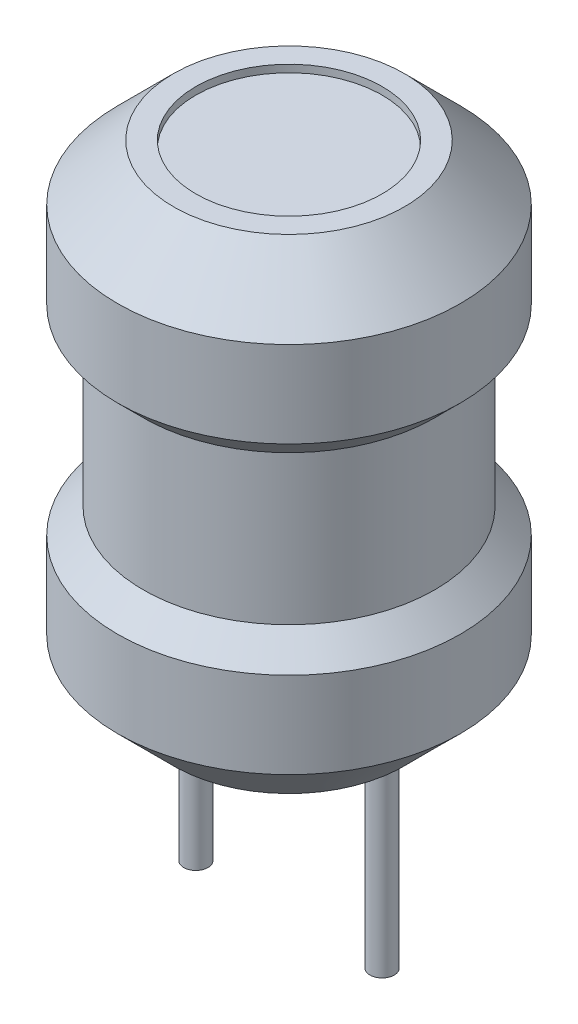
ISO-10303-21;
HEADER;
FILE_DESCRIPTION(('STEP AP214'),'2;1');
FILE_NAME('part.step','',(''),(''),'','','');
FILE_SCHEMA(('AUTOMOTIVE_DESIGN { 1 0 10303 214 1 1 1 1 }'));
ENDSEC;
DATA;
#1=APPLICATION_CONTEXT('core data for automotive mechanical design processes');
#2=APPLICATION_PROTOCOL_DEFINITION('international standard','automotive_design',2000,#1);
#3=PRODUCT_CONTEXT('',#1,'mechanical');
#4=PRODUCT('Part','Part','',(#3));
#5=PRODUCT_RELATED_PRODUCT_CATEGORY('part','',(#4));
#6=PRODUCT_DEFINITION_FORMATION('','',#4);
#7=PRODUCT_DEFINITION_CONTEXT('part definition',#1,'design');
#8=PRODUCT_DEFINITION('design','',#6,#7);
#9=PRODUCT_DEFINITION_SHAPE('','',#8);
#10=(LENGTH_UNIT() NAMED_UNIT(*) SI_UNIT(.MILLI.,.METRE.));
#11=(NAMED_UNIT(*) PLANE_ANGLE_UNIT() SI_UNIT($,.RADIAN.));
#12=(NAMED_UNIT(*) SI_UNIT($,.STERADIAN.) SOLID_ANGLE_UNIT());
#13=UNCERTAINTY_MEASURE_WITH_UNIT(LENGTH_MEASURE(1.E-05),#10,'distance_accuracy_value','');
#14=(GEOMETRIC_REPRESENTATION_CONTEXT(3) GLOBAL_UNCERTAINTY_ASSIGNED_CONTEXT((#13)) GLOBAL_UNIT_ASSIGNED_CONTEXT((#10,
#11,#12)) REPRESENTATION_CONTEXT('',''));
#15=CARTESIAN_POINT('',(0.,0.,0.));
#16=DIRECTION('',(0.,0.,1.));
#17=DIRECTION('',(1.,0.,0.));
#18=AXIS2_PLACEMENT_3D('',#15,#16,#17);
#19=CARTESIAN_POINT('',(3.1,0.,0.));
#20=DIRECTION('',(0.,1.,0.));
#21=DIRECTION('',(-1.,0.,0.));
#22=AXIS2_PLACEMENT_3D('',#19,#20,#21);
#23=PLANE('',#22);
#24=CARTESIAN_POINT('',(-2.5,0.,0.));
#25=DIRECTION('',(0.,1.,0.));
#26=DIRECTION('',(-1.,0.,0.));
#27=AXIS2_PLACEMENT_3D('',#24,#25,#26);
#28=CIRCLE('',#27,0.325);
#29=CARTESIAN_POINT('',(-2.825,0.,0.));
#30=VERTEX_POINT('',#29);
#31=EDGE_CURVE('E10',#30,#30,#28,.F.);
#32=ORIENTED_EDGE('',*,*,#31,.F.);
#33=EDGE_LOOP('',(#32));
#34=FACE_BOUND('',#33,.T.);
#35=CARTESIAN_POINT('',(2.5,0.,0.));
#36=DIRECTION('',(0.,1.,0.));
#37=DIRECTION('',(-1.,0.,0.));
#38=AXIS2_PLACEMENT_3D('',#35,#36,#37);
#39=CIRCLE('',#38,0.325);
#40=CARTESIAN_POINT('',(2.175,0.,0.));
#41=VERTEX_POINT('',#40);
#42=EDGE_CURVE('E44',#41,#41,#39,.F.);
#43=ORIENTED_EDGE('',*,*,#42,.F.);
#44=EDGE_LOOP('',(#43));
#45=FACE_BOUND('',#44,.T.);
#46=CARTESIAN_POINT('',(0.,0.,0.));
#47=DIRECTION('',(0.,1.,0.));
#48=DIRECTION('',(-1.,0.,0.));
#49=AXIS2_PLACEMENT_3D('',#46,#47,#48);
#50=CIRCLE('',#49,3.1);
#51=CARTESIAN_POINT('',(-3.1,0.,0.));
#52=VERTEX_POINT('',#51);
#53=EDGE_CURVE('E49',#52,#52,#50,.T.);
#54=ORIENTED_EDGE('',*,*,#53,.F.);
#55=EDGE_LOOP('',(#54));
#56=FACE_BOUND('',#55,.T.);
#57=ADVANCED_FACE('F37',(#34,#45,#56),#23,.F.);
#58=CARTESIAN_POINT('',(0.,0.,0.));
#59=DIRECTION('',(0.,1.,0.));
#60=DIRECTION('',(-1.,0.,0.));
#61=AXIS2_PLACEMENT_3D('',#58,#59,#60);
#62=CONICAL_SURFACE('',#61,3.1,0.785398163397449);
#63=CARTESIAN_POINT('',(0.,1.5,0.));
#64=DIRECTION('',(0.,1.,0.));
#65=DIRECTION('',(-1.,0.,0.));
#66=AXIS2_PLACEMENT_3D('',#63,#64,#65);
#67=CIRCLE('',#66,4.6);
#68=CARTESIAN_POINT('',(-4.6,1.5,0.));
#69=VERTEX_POINT('',#68);
#70=EDGE_CURVE('E54',#69,#69,#67,.T.);
#71=ORIENTED_EDGE('',*,*,#70,.F.);
#72=EDGE_LOOP('',(#71));
#73=FACE_BOUND('',#72,.T.);
#74=ORIENTED_EDGE('',*,*,#53,.T.);
#75=EDGE_LOOP('',(#74));
#76=FACE_BOUND('',#75,.T.);
#77=ADVANCED_FACE('F150',(#73,#76),#62,.T.);
#78=CARTESIAN_POINT('',(0.,13.,0.));
#79=DIRECTION('',(0.,1.,0.));
#80=DIRECTION('',(-1.,0.,0.));
#81=AXIS2_PLACEMENT_3D('',#78,#79,#80);
#82=CYLINDRICAL_SURFACE('',#81,4.6);
#83=CARTESIAN_POINT('',(0.,3.81241431788566,0.));
#84=DIRECTION('',(0.,1.,0.));
#85=DIRECTION('',(-1.,0.,0.));
#86=AXIS2_PLACEMENT_3D('',#83,#84,#85);
#87=CIRCLE('',#86,4.6);
#88=CARTESIAN_POINT('',(-4.6,3.81241431788566,0.));
#89=VERTEX_POINT('',#88);
#90=EDGE_CURVE('E60',#89,#89,#87,.T.);
#91=ORIENTED_EDGE('',*,*,#90,.F.);
#92=EDGE_LOOP('',(#91));
#93=FACE_BOUND('',#92,.T.);
#94=ORIENTED_EDGE('',*,*,#70,.T.);
#95=EDGE_LOOP('',(#94));
#96=FACE_BOUND('',#95,.T.);
#97=ADVANCED_FACE('F144',(#93,#96),#82,.T.);
#98=CARTESIAN_POINT('',(0.,3.81241431788566,0.));
#99=DIRECTION('',(0.,-1.,0.));
#100=DIRECTION('',(1.,0.,0.));
#101=AXIS2_PLACEMENT_3D('',#98,#99,#100);
#102=CONICAL_SURFACE('',#101,4.6,0.78539816339745);
#103=CARTESIAN_POINT('',(0.,4.5,0.));
#104=DIRECTION('',(0.,1.,0.));
#105=DIRECTION('',(-1.,0.,0.));
#106=AXIS2_PLACEMENT_3D('',#103,#104,#105);
#107=CIRCLE('',#106,3.91241431788566);
#108=CARTESIAN_POINT('',(-3.91241431788566,4.5,0.));
#109=VERTEX_POINT('',#108);
#110=EDGE_CURVE('E64',#109,#109,#107,.T.);
#111=ORIENTED_EDGE('',*,*,#110,.F.);
#112=EDGE_LOOP('',(#111));
#113=FACE_BOUND('',#112,.T.);
#114=ORIENTED_EDGE('',*,*,#90,.T.);
#115=EDGE_LOOP('',(#114));
#116=FACE_BOUND('',#115,.T.);
#117=ADVANCED_FACE('F138',(#113,#116),#102,.T.);
#118=CARTESIAN_POINT('',(0.,13.,0.));
#119=DIRECTION('',(0.,1.,0.));
#120=DIRECTION('',(-1.,0.,0.));
#121=AXIS2_PLACEMENT_3D('',#118,#119,#120);
#122=CYLINDRICAL_SURFACE('',#121,3.91241431788566);
#123=CARTESIAN_POINT('',(0.,8.5,0.));
#124=DIRECTION('',(0.,1.,0.));
#125=DIRECTION('',(-1.,0.,0.));
#126=AXIS2_PLACEMENT_3D('',#123,#124,#125);
#127=CIRCLE('',#126,3.91241431788566);
#128=CARTESIAN_POINT('',(-3.91241431788566,8.5,0.));
#129=VERTEX_POINT('',#128);
#130=EDGE_CURVE('E68',#129,#129,#127,.T.);
#131=ORIENTED_EDGE('',*,*,#130,.F.);
#132=EDGE_LOOP('',(#131));
#133=FACE_BOUND('',#132,.T.);
#134=ORIENTED_EDGE('',*,*,#110,.T.);
#135=EDGE_LOOP('',(#134));
#136=FACE_BOUND('',#135,.T.);
#137=ADVANCED_FACE('F132',(#133,#136),#122,.T.);
#138=CARTESIAN_POINT('',(0.,8.5,0.));
#139=DIRECTION('',(0.,1.,0.));
#140=DIRECTION('',(-1.,0.,0.));
#141=AXIS2_PLACEMENT_3D('',#138,#139,#140);
#142=CONICAL_SURFACE('',#141,3.91241431788566,0.785398163397448);
#143=CARTESIAN_POINT('',(0.,9.18758568211434,0.));
#144=DIRECTION('',(0.,1.,0.));
#145=DIRECTION('',(-1.,0.,0.));
#146=AXIS2_PLACEMENT_3D('',#143,#144,#145);
#147=CIRCLE('',#146,4.6);
#148=CARTESIAN_POINT('',(-4.6,9.18758568211434,0.));
#149=VERTEX_POINT('',#148);
#150=EDGE_CURVE('E72',#149,#149,#147,.T.);
#151=ORIENTED_EDGE('',*,*,#150,.F.);
#152=EDGE_LOOP('',(#151));
#153=FACE_BOUND('',#152,.T.);
#154=ORIENTED_EDGE('',*,*,#130,.T.);
#155=EDGE_LOOP('',(#154));
#156=FACE_BOUND('',#155,.T.);
#157=ADVANCED_FACE('F126',(#153,#156),#142,.T.);
#158=CARTESIAN_POINT('',(0.,13.,0.));
#159=DIRECTION('',(0.,1.,0.));
#160=DIRECTION('',(-1.,0.,0.));
#161=AXIS2_PLACEMENT_3D('',#158,#159,#160);
#162=CYLINDRICAL_SURFACE('',#161,4.6);
#163=CARTESIAN_POINT('',(0.,11.5,0.));
#164=DIRECTION('',(0.,1.,0.));
#165=DIRECTION('',(-1.,0.,0.));
#166=AXIS2_PLACEMENT_3D('',#163,#164,#165);
#167=CIRCLE('',#166,4.6);
#168=CARTESIAN_POINT('',(-4.6,11.5,0.));
#169=VERTEX_POINT('',#168);
#170=EDGE_CURVE('E76',#169,#169,#167,.T.);
#171=ORIENTED_EDGE('',*,*,#170,.F.);
#172=EDGE_LOOP('',(#171));
#173=FACE_BOUND('',#172,.T.);
#174=ORIENTED_EDGE('',*,*,#150,.T.);
#175=EDGE_LOOP('',(#174));
#176=FACE_BOUND('',#175,.T.);
#177=ADVANCED_FACE('F120',(#173,#176),#162,.T.);
#178=CARTESIAN_POINT('',(0.,11.5,0.));
#179=DIRECTION('',(0.,-1.,0.));
#180=DIRECTION('',(1.,0.,0.));
#181=AXIS2_PLACEMENT_3D('',#178,#179,#180);
#182=CONICAL_SURFACE('',#181,4.6,0.785398163397448);
#183=CARTESIAN_POINT('',(0.,13.,0.));
#184=DIRECTION('',(0.,1.,0.));
#185=DIRECTION('',(-1.,0.,0.));
#186=AXIS2_PLACEMENT_3D('',#183,#184,#185);
#187=CIRCLE('',#186,3.1);
#188=CARTESIAN_POINT('',(-3.1,13.,0.));
#189=VERTEX_POINT('',#188);
#190=EDGE_CURVE('E80',#189,#189,#187,.T.);
#191=ORIENTED_EDGE('',*,*,#190,.F.);
#192=EDGE_LOOP('',(#191));
#193=FACE_BOUND('',#192,.T.);
#194=ORIENTED_EDGE('',*,*,#170,.T.);
#195=EDGE_LOOP('',(#194));
#196=FACE_BOUND('',#195,.T.);
#197=ADVANCED_FACE('F114',(#193,#196),#182,.T.);
#198=CARTESIAN_POINT('',(0.,13.,0.));
#199=DIRECTION('',(0.,-1.,0.));
#200=DIRECTION('',(1.,0.,0.));
#201=AXIS2_PLACEMENT_3D('',#198,#199,#200);
#202=PLANE('',#201);
#203=CARTESIAN_POINT('',(0.,13.,0.));
#204=DIRECTION('',(0.,1.,0.));
#205=DIRECTION('',(-1.,0.,0.));
#206=AXIS2_PLACEMENT_3D('',#203,#204,#205);
#207=CIRCLE('',#206,2.5);
#208=CARTESIAN_POINT('',(-2.5,13.,0.));
#209=VERTEX_POINT('',#208);
#210=EDGE_CURVE('E93',#209,#209,#207,.T.);
#211=ORIENTED_EDGE('',*,*,#210,.F.);
#212=EDGE_LOOP('',(#211));
#213=FACE_BOUND('',#212,.T.);
#214=ORIENTED_EDGE('',*,*,#190,.T.);
#215=EDGE_LOOP('',(#214));
#216=FACE_BOUND('',#215,.T.);
#217=ADVANCED_FACE('F110',(#213,#216),#202,.F.);
#218=CARTESIAN_POINT('',(2.5,-5.,0.));
#219=DIRECTION('',(0.,1.,0.));
#220=DIRECTION('',(-1.,0.,0.));
#221=AXIS2_PLACEMENT_3D('',#218,#219,#220);
#222=CYLINDRICAL_SURFACE('',#221,0.325);
#223=CARTESIAN_POINT('',(2.5,-5.,0.));
#224=DIRECTION('',(0.,-1.,0.));
#225=DIRECTION('',(1.,0.,0.));
#226=AXIS2_PLACEMENT_3D('',#223,#224,#225);
#227=CIRCLE('',#226,0.325);
#228=CARTESIAN_POINT('',(2.825,-5.,0.));
#229=VERTEX_POINT('',#228);
#230=EDGE_CURVE('E84',#229,#229,#227,.T.);
#231=ORIENTED_EDGE('',*,*,#230,.F.);
#232=EDGE_LOOP('',(#231));
#233=FACE_BOUND('',#232,.T.);
#234=ORIENTED_EDGE('',*,*,#42,.T.);
#235=EDGE_LOOP('',(#234));
#236=FACE_BOUND('',#235,.T.);
#237=ADVANCED_FACE('F113',(#233,#236),#222,.T.);
#238=CARTESIAN_POINT('',(2.5,-5.,0.));
#239=DIRECTION('',(0.,-1.,0.));
#240=DIRECTION('',(1.,0.,0.));
#241=AXIS2_PLACEMENT_3D('',#238,#239,#240);
#242=PLANE('',#241);
#243=ORIENTED_EDGE('',*,*,#230,.T.);
#244=EDGE_LOOP('',(#243));
#245=FACE_BOUND('',#244,.T.);
#246=ADVANCED_FACE('F203',(#245),#242,.T.);
#247=CARTESIAN_POINT('',(-2.5,-5.,0.));
#248=DIRECTION('',(0.,1.,0.));
#249=DIRECTION('',(-1.,0.,0.));
#250=AXIS2_PLACEMENT_3D('',#247,#248,#249);
#251=CYLINDRICAL_SURFACE('',#250,0.325);
#252=CARTESIAN_POINT('',(-2.5,-5.,0.));
#253=DIRECTION('',(0.,-1.,0.));
#254=DIRECTION('',(-1.,0.,0.));
#255=AXIS2_PLACEMENT_3D('',#252,#253,#254);
#256=CIRCLE('',#255,0.325);
#257=CARTESIAN_POINT('',(-2.825,-5.,0.));
#258=VERTEX_POINT('',#257);
#259=EDGE_CURVE('E88',#258,#258,#256,.T.);
#260=ORIENTED_EDGE('',*,*,#259,.F.);
#261=EDGE_LOOP('',(#260));
#262=FACE_BOUND('',#261,.T.);
#263=ORIENTED_EDGE('',*,*,#31,.T.);
#264=EDGE_LOOP('',(#263));
#265=FACE_BOUND('',#264,.T.);
#266=ADVANCED_FACE('F211',(#262,#265),#251,.T.);
#267=CARTESIAN_POINT('',(-2.5,-5.,0.));
#268=DIRECTION('',(0.,1.,0.));
#269=DIRECTION('',(-1.,0.,0.));
#270=AXIS2_PLACEMENT_3D('',#267,#268,#269);
#271=PLANE('',#270);
#272=ORIENTED_EDGE('',*,*,#259,.T.);
#273=EDGE_LOOP('',(#272));
#274=FACE_BOUND('',#273,.T.);
#275=ADVANCED_FACE('F106',(#274),#271,.F.);
#276=CARTESIAN_POINT('',(0.,12.8,0.));
#277=DIRECTION('',(0.,1.,0.));
#278=DIRECTION('',(-1.,0.,0.));
#279=AXIS2_PLACEMENT_3D('',#276,#277,#278);
#280=CYLINDRICAL_SURFACE('',#279,2.5);
#281=CARTESIAN_POINT('',(0.,12.8,0.));
#282=DIRECTION('',(0.,1.,0.));
#283=DIRECTION('',(-1.,0.,0.));
#284=AXIS2_PLACEMENT_3D('',#281,#282,#283);
#285=CIRCLE('',#284,2.5);
#286=CARTESIAN_POINT('',(-2.5,12.8,0.));
#287=VERTEX_POINT('',#286);
#288=EDGE_CURVE('E92',#287,#287,#285,.T.);
#289=ORIENTED_EDGE('',*,*,#288,.F.);
#290=EDGE_LOOP('',(#289));
#291=FACE_BOUND('',#290,.T.);
#292=ORIENTED_EDGE('',*,*,#210,.T.);
#293=EDGE_LOOP('',(#292));
#294=FACE_BOUND('',#293,.T.);
#295=ADVANCED_FACE('F103',(#291,#294),#280,.F.);
#296=CARTESIAN_POINT('',(0.,12.8,0.));
#297=DIRECTION('',(0.,1.,0.));
#298=DIRECTION('',(-1.,0.,0.));
#299=AXIS2_PLACEMENT_3D('',#296,#297,#298);
#300=PLANE('',#299);
#301=ORIENTED_EDGE('',*,*,#288,.T.);
#302=EDGE_LOOP('',(#301));
#303=FACE_BOUND('',#302,.T.);
#304=ADVANCED_FACE('F101',(#303),#300,.T.);
#305=CLOSED_SHELL('',(#57,#77,#97,#117,#137,#157,#177,#197,#217,#237,#246,#266,#275,#295,#304));
#306=MANIFOLD_SOLID_BREP('B2',#305);
#307=ADVANCED_BREP_SHAPE_REPRESENTATION('',(#18,#306),#14);
#308=SHAPE_DEFINITION_REPRESENTATION(#9,#307);
ENDSEC;
END-ISO-10303-21;
